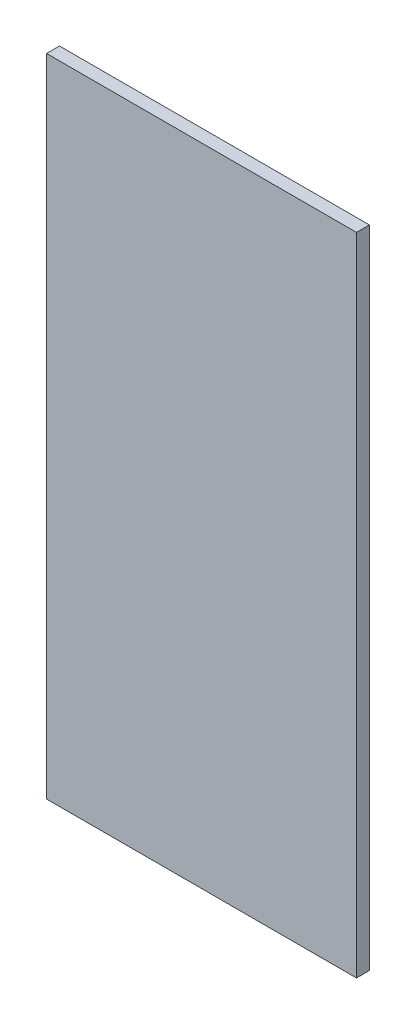
ISO-10303-21;
HEADER;
FILE_DESCRIPTION(('STEP AP214'),'2;1');
FILE_NAME('part.step','',(''),(''),'','','');
FILE_SCHEMA(('AUTOMOTIVE_DESIGN { 1 0 10303 214 1 1 1 1 }'));
ENDSEC;
DATA;
#1=APPLICATION_CONTEXT('core data for automotive mechanical design processes');
#2=APPLICATION_PROTOCOL_DEFINITION('international standard','automotive_design',2000,#1);
#3=PRODUCT_CONTEXT('',#1,'mechanical');
#4=PRODUCT('Part','Part','',(#3));
#5=PRODUCT_RELATED_PRODUCT_CATEGORY('part','',(#4));
#6=PRODUCT_DEFINITION_FORMATION('','',#4);
#7=PRODUCT_DEFINITION_CONTEXT('part definition',#1,'design');
#8=PRODUCT_DEFINITION('design','',#6,#7);
#9=PRODUCT_DEFINITION_SHAPE('','',#8);
#10=(LENGTH_UNIT() NAMED_UNIT(*) SI_UNIT(.MILLI.,.METRE.));
#11=(NAMED_UNIT(*) PLANE_ANGLE_UNIT() SI_UNIT($,.RADIAN.));
#12=(NAMED_UNIT(*) SI_UNIT($,.STERADIAN.) SOLID_ANGLE_UNIT());
#13=UNCERTAINTY_MEASURE_WITH_UNIT(LENGTH_MEASURE(1.E-05),#10,'distance_accuracy_value','');
#14=(GEOMETRIC_REPRESENTATION_CONTEXT(3) GLOBAL_UNCERTAINTY_ASSIGNED_CONTEXT((#13)) GLOBAL_UNIT_ASSIGNED_CONTEXT((#10,
#11,#12)) REPRESENTATION_CONTEXT('',''));
#15=CARTESIAN_POINT('',(0.,0.,0.));
#16=DIRECTION('',(0.,0.,1.));
#17=DIRECTION('',(1.,0.,0.));
#18=AXIS2_PLACEMENT_3D('',#15,#16,#17);
#19=CARTESIAN_POINT('',(76.2,158.75,6.35));
#20=DIRECTION('',(-1.,0.,0.));
#21=DIRECTION('',(0.,-1.,0.));
#22=AXIS2_PLACEMENT_3D('',#19,#20,#21);
#23=PLANE('',#22);
#24=DIRECTION('',(0.,1.,0.));
#25=VECTOR('',#24,1.);
#26=CARTESIAN_POINT('',(76.2,158.75,0.));
#27=LINE('',#26,#25);
#28=CARTESIAN_POINT('',(76.2,-158.75,0.));
#29=VERTEX_POINT('',#28);
#30=CARTESIAN_POINT('',(76.2,158.75,0.));
#31=VERTEX_POINT('',#30);
#32=EDGE_CURVE('E97',#29,#31,#27,.T.);
#33=ORIENTED_EDGE('',*,*,#32,.T.);
#34=DIRECTION('',(0.,0.,-1.));
#35=VECTOR('',#34,1.);
#36=CARTESIAN_POINT('',(76.2,158.75,6.35));
#37=LINE('',#36,#35);
#38=CARTESIAN_POINT('',(76.2,158.75,6.35));
#39=VERTEX_POINT('',#38);
#40=EDGE_CURVE('E11',#39,#31,#37,.T.);
#41=ORIENTED_EDGE('',*,*,#40,.F.);
#42=DIRECTION('',(0.,1.,0.));
#43=VECTOR('',#42,1.);
#44=CARTESIAN_POINT('',(76.2,158.75,6.35));
#45=LINE('',#44,#43);
#46=CARTESIAN_POINT('',(76.2,-158.75,6.35));
#47=VERTEX_POINT('',#46);
#48=EDGE_CURVE('E85',#47,#39,#45,.T.);
#49=ORIENTED_EDGE('',*,*,#48,.F.);
#50=DIRECTION('',(0.,0.,-1.));
#51=VECTOR('',#50,1.);
#52=CARTESIAN_POINT('',(76.2,-158.75,6.35));
#53=LINE('',#52,#51);
#54=EDGE_CURVE('E93',#47,#29,#53,.T.);
#55=ORIENTED_EDGE('',*,*,#54,.T.);
#56=EDGE_LOOP('',(#33,#41,#49,#55));
#57=FACE_BOUND('',#56,.T.);
#58=ADVANCED_FACE('F34',(#57),#23,.F.);
#59=CARTESIAN_POINT('',(-76.2,158.75,6.35));
#60=DIRECTION('',(0.,-1.,0.));
#61=DIRECTION('',(0.,0.,-1.));
#62=AXIS2_PLACEMENT_3D('',#59,#60,#61);
#63=PLANE('',#62);
#64=DIRECTION('',(-1.,0.,0.));
#65=VECTOR('',#64,1.);
#66=CARTESIAN_POINT('',(-76.2,158.75,0.));
#67=LINE('',#66,#65);
#68=CARTESIAN_POINT('',(-76.2,158.75,0.));
#69=VERTEX_POINT('',#68);
#70=EDGE_CURVE('E89',#31,#69,#67,.T.);
#71=ORIENTED_EDGE('',*,*,#70,.T.);
#72=DIRECTION('',(0.,0.,-1.));
#73=VECTOR('',#72,1.);
#74=CARTESIAN_POINT('',(-76.2,158.75,6.35));
#75=LINE('',#74,#73);
#76=CARTESIAN_POINT('',(-76.2,158.75,6.35));
#77=VERTEX_POINT('',#76);
#78=EDGE_CURVE('E42',#77,#69,#75,.T.);
#79=ORIENTED_EDGE('',*,*,#78,.F.);
#80=DIRECTION('',(-1.,0.,0.));
#81=VECTOR('',#80,1.);
#82=CARTESIAN_POINT('',(-76.2,158.75,6.35));
#83=LINE('',#82,#81);
#84=EDGE_CURVE('E80',#39,#77,#83,.T.);
#85=ORIENTED_EDGE('',*,*,#84,.F.);
#86=ORIENTED_EDGE('',*,*,#40,.T.);
#87=EDGE_LOOP('',(#71,#79,#85,#86));
#88=FACE_BOUND('',#87,.T.);
#89=ADVANCED_FACE('F88',(#88),#63,.F.);
#90=CARTESIAN_POINT('',(-76.2,158.75,6.35));
#91=DIRECTION('',(1.,0.,0.));
#92=DIRECTION('',(0.,1.,0.));
#93=AXIS2_PLACEMENT_3D('',#90,#91,#92);
#94=PLANE('',#93);
#95=DIRECTION('',(0.,-1.,0.));
#96=VECTOR('',#95,1.);
#97=CARTESIAN_POINT('',(-76.2,158.75,0.));
#98=LINE('',#97,#96);
#99=CARTESIAN_POINT('',(-76.2,-158.75,0.));
#100=VERTEX_POINT('',#99);
#101=EDGE_CURVE('E67',#69,#100,#98,.T.);
#102=ORIENTED_EDGE('',*,*,#101,.T.);
#103=DIRECTION('',(0.,0.,-1.));
#104=VECTOR('',#103,1.);
#105=CARTESIAN_POINT('',(-76.2,-158.75,6.35));
#106=LINE('',#105,#104);
#107=CARTESIAN_POINT('',(-76.2,-158.75,6.35));
#108=VERTEX_POINT('',#107);
#109=EDGE_CURVE('E90',#108,#100,#106,.T.);
#110=ORIENTED_EDGE('',*,*,#109,.F.);
#111=DIRECTION('',(0.,-1.,0.));
#112=VECTOR('',#111,1.);
#113=CARTESIAN_POINT('',(-76.2,158.75,6.35));
#114=LINE('',#113,#112);
#115=EDGE_CURVE('E83',#77,#108,#114,.T.);
#116=ORIENTED_EDGE('',*,*,#115,.F.);
#117=ORIENTED_EDGE('',*,*,#78,.T.);
#118=EDGE_LOOP('',(#102,#110,#116,#117));
#119=FACE_BOUND('',#118,.T.);
#120=ADVANCED_FACE('F91',(#119),#94,.F.);
#121=CARTESIAN_POINT('',(-76.2,-158.75,6.35));
#122=DIRECTION('',(0.,1.,0.));
#123=DIRECTION('',(0.,0.,1.));
#124=AXIS2_PLACEMENT_3D('',#121,#122,#123);
#125=PLANE('',#124);
#126=DIRECTION('',(1.,0.,0.));
#127=VECTOR('',#126,1.);
#128=CARTESIAN_POINT('',(-76.2,-158.75,0.));
#129=LINE('',#128,#127);
#130=EDGE_CURVE('E73',#100,#29,#129,.T.);
#131=ORIENTED_EDGE('',*,*,#130,.T.);
#132=ORIENTED_EDGE('',*,*,#54,.F.);
#133=DIRECTION('',(1.,0.,0.));
#134=VECTOR('',#133,1.);
#135=CARTESIAN_POINT('',(-76.2,-158.75,6.35));
#136=LINE('',#135,#134);
#137=EDGE_CURVE('E50',#108,#47,#136,.T.);
#138=ORIENTED_EDGE('',*,*,#137,.F.);
#139=ORIENTED_EDGE('',*,*,#109,.T.);
#140=EDGE_LOOP('',(#131,#132,#138,#139));
#141=FACE_BOUND('',#140,.T.);
#142=ADVANCED_FACE('F104',(#141),#125,.F.);
#143=CARTESIAN_POINT('',(0.,0.,6.35));
#144=DIRECTION('',(0.,0.,1.));
#145=DIRECTION('',(1.,0.,0.));
#146=AXIS2_PLACEMENT_3D('',#143,#144,#145);
#147=PLANE('',#146);
#148=ORIENTED_EDGE('',*,*,#48,.T.);
#149=ORIENTED_EDGE('',*,*,#84,.T.);
#150=ORIENTED_EDGE('',*,*,#115,.T.);
#151=ORIENTED_EDGE('',*,*,#137,.T.);
#152=EDGE_LOOP('',(#148,#149,#150,#151));
#153=FACE_BOUND('',#152,.T.);
#154=ADVANCED_FACE('F81',(#153),#147,.T.);
#155=CARTESIAN_POINT('',(0.,0.,0.));
#156=DIRECTION('',(0.,0.,1.));
#157=DIRECTION('',(1.,0.,0.));
#158=AXIS2_PLACEMENT_3D('',#155,#156,#157);
#159=PLANE('',#158);
#160=ORIENTED_EDGE('',*,*,#32,.F.);
#161=ORIENTED_EDGE('',*,*,#130,.F.);
#162=ORIENTED_EDGE('',*,*,#101,.F.);
#163=ORIENTED_EDGE('',*,*,#70,.F.);
#164=EDGE_LOOP('',(#160,#161,#162,#163));
#165=FACE_BOUND('',#164,.T.);
#166=ADVANCED_FACE('F107',(#165),#159,.F.);
#167=CLOSED_SHELL('',(#58,#89,#120,#142,#154,#166));
#168=MANIFOLD_SOLID_BREP('B2',#167);
#169=ADVANCED_BREP_SHAPE_REPRESENTATION('',(#18,#168),#14);
#170=SHAPE_DEFINITION_REPRESENTATION(#9,#169);
ENDSEC;
END-ISO-10303-21;
